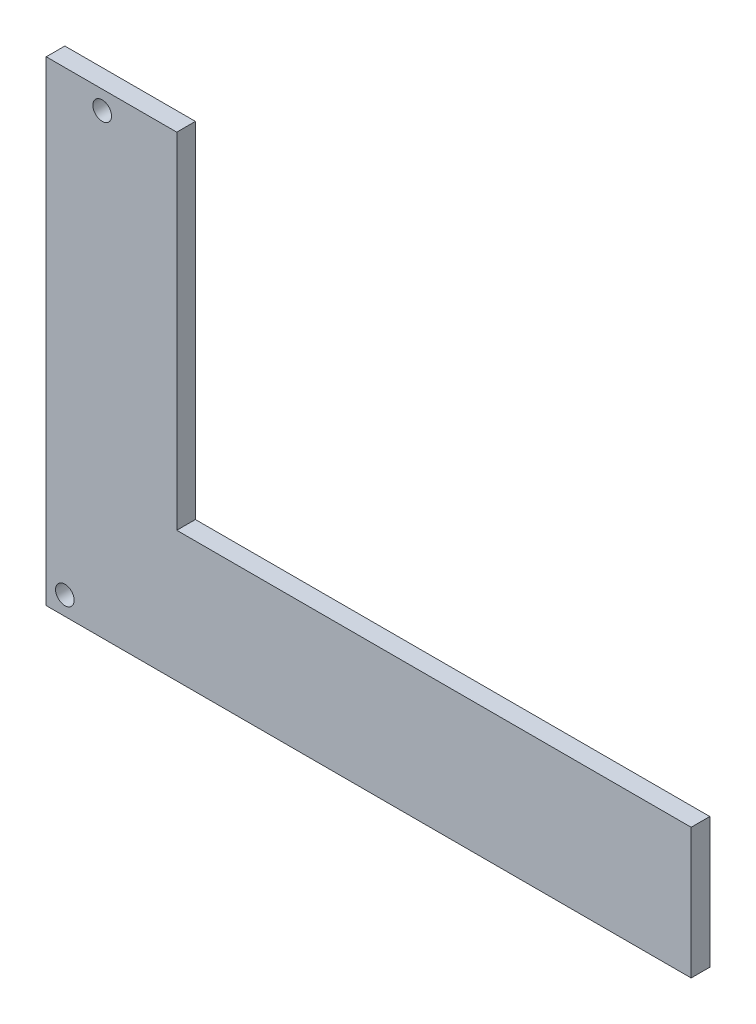
ISO-10303-21;
HEADER;
FILE_DESCRIPTION(('STEP AP214'),'2;1');
FILE_NAME('part.step','',(''),(''),'','','');
FILE_SCHEMA(('AUTOMOTIVE_DESIGN { 1 0 10303 214 1 1 1 1 }'));
ENDSEC;
DATA;
#1=APPLICATION_CONTEXT('core data for automotive mechanical design processes');
#2=APPLICATION_PROTOCOL_DEFINITION('international standard','automotive_design',2000,#1);
#3=PRODUCT_CONTEXT('',#1,'mechanical');
#4=PRODUCT('Part','Part','',(#3));
#5=PRODUCT_RELATED_PRODUCT_CATEGORY('part','',(#4));
#6=PRODUCT_DEFINITION_FORMATION('','',#4);
#7=PRODUCT_DEFINITION_CONTEXT('part definition',#1,'design');
#8=PRODUCT_DEFINITION('design','',#6,#7);
#9=PRODUCT_DEFINITION_SHAPE('','',#8);
#10=(LENGTH_UNIT() NAMED_UNIT(*) SI_UNIT(.MILLI.,.METRE.));
#11=(NAMED_UNIT(*) PLANE_ANGLE_UNIT() SI_UNIT($,.RADIAN.));
#12=(NAMED_UNIT(*) SI_UNIT($,.STERADIAN.) SOLID_ANGLE_UNIT());
#13=UNCERTAINTY_MEASURE_WITH_UNIT(LENGTH_MEASURE(1.E-05),#10,'distance_accuracy_value','');
#14=(GEOMETRIC_REPRESENTATION_CONTEXT(3) GLOBAL_UNCERTAINTY_ASSIGNED_CONTEXT((#13)) GLOBAL_UNIT_ASSIGNED_CONTEXT((#10,
#11,#12)) REPRESENTATION_CONTEXT('',''));
#15=CARTESIAN_POINT('',(0.,0.,0.));
#16=DIRECTION('',(0.,0.,1.));
#17=DIRECTION('',(1.,0.,0.));
#18=AXIS2_PLACEMENT_3D('',#15,#16,#17);
#19=CARTESIAN_POINT('',(155.,-17.9999999999984,5.));
#20=DIRECTION('',(-1.,0.,0.));
#21=DIRECTION('',(0.,0.,1.));
#22=AXIS2_PLACEMENT_3D('',#19,#20,#21);
#23=PLANE('',#22);
#24=DIRECTION('',(0.,1.,0.));
#25=VECTOR('',#24,1.);
#26=CARTESIAN_POINT('',(155.,-17.9999999999984,0.));
#27=LINE('',#26,#25);
#28=CARTESIAN_POINT('',(155.,-17.9999999999984,0.));
#29=VERTEX_POINT('',#28);
#30=CARTESIAN_POINT('',(155.,17.0179350816866,0.));
#31=VERTEX_POINT('',#30);
#32=EDGE_CURVE('E119',#29,#31,#27,.T.);
#33=ORIENTED_EDGE('',*,*,#32,.T.);
#34=DIRECTION('',(0.,0.,-1.));
#35=VECTOR('',#34,1.);
#36=CARTESIAN_POINT('',(155.,17.0179350816866,5.));
#37=LINE('',#36,#35);
#38=CARTESIAN_POINT('',(155.,17.0179350816866,5.));
#39=VERTEX_POINT('',#38);
#40=EDGE_CURVE('E11',#39,#31,#37,.T.);
#41=ORIENTED_EDGE('',*,*,#40,.F.);
#42=DIRECTION('',(0.,1.,0.));
#43=VECTOR('',#42,1.);
#44=CARTESIAN_POINT('',(155.,-17.9999999999984,5.));
#45=LINE('',#44,#43);
#46=CARTESIAN_POINT('',(155.,-17.9999999999984,5.));
#47=VERTEX_POINT('',#46);
#48=EDGE_CURVE('E130',#47,#39,#45,.T.);
#49=ORIENTED_EDGE('',*,*,#48,.F.);
#50=DIRECTION('',(0.,0.,-1.));
#51=VECTOR('',#50,1.);
#52=CARTESIAN_POINT('',(155.,-17.9999999999984,5.));
#53=LINE('',#52,#51);
#54=EDGE_CURVE('E115',#47,#29,#53,.T.);
#55=ORIENTED_EDGE('',*,*,#54,.T.);
#56=EDGE_LOOP('',(#33,#41,#49,#55));
#57=FACE_BOUND('',#56,.T.);
#58=ADVANCED_FACE('F35',(#57),#23,.F.);
#59=CARTESIAN_POINT('',(17.0187176122605,17.0179350816866,5.));
#60=DIRECTION('',(0.,-1.,0.));
#61=DIRECTION('',(1.,0.,0.));
#62=AXIS2_PLACEMENT_3D('',#59,#60,#61);
#63=PLANE('',#62);
#64=DIRECTION('',(-1.,0.,0.));
#65=VECTOR('',#64,1.);
#66=CARTESIAN_POINT('',(17.0187176122605,17.0179350816866,0.));
#67=LINE('',#66,#65);
#68=CARTESIAN_POINT('',(17.0187176122605,17.0179350816866,0.));
#69=VERTEX_POINT('',#68);
#70=EDGE_CURVE('E122',#31,#69,#67,.T.);
#71=ORIENTED_EDGE('',*,*,#70,.T.);
#72=DIRECTION('',(0.,0.,-1.));
#73=VECTOR('',#72,1.);
#74=CARTESIAN_POINT('',(17.0187176122605,17.0179350816866,5.));
#75=LINE('',#74,#73);
#76=CARTESIAN_POINT('',(17.0187176122605,17.0179350816866,5.));
#77=VERTEX_POINT('',#76);
#78=EDGE_CURVE('E43',#77,#69,#75,.T.);
#79=ORIENTED_EDGE('',*,*,#78,.F.);
#80=DIRECTION('',(-1.,0.,0.));
#81=VECTOR('',#80,1.);
#82=CARTESIAN_POINT('',(17.0187176122605,17.0179350816866,5.));
#83=LINE('',#82,#81);
#84=EDGE_CURVE('E88',#39,#77,#83,.T.);
#85=ORIENTED_EDGE('',*,*,#84,.F.);
#86=ORIENTED_EDGE('',*,*,#40,.T.);
#87=EDGE_LOOP('',(#71,#79,#85,#86));
#88=FACE_BOUND('',#87,.T.);
#89=ADVANCED_FACE('F155',(#88),#63,.F.);
#90=CARTESIAN_POINT('',(17.0187176122605,17.0179350816866,5.));
#91=DIRECTION('',(-1.,0.,0.));
#92=DIRECTION('',(0.,-1.,0.));
#93=AXIS2_PLACEMENT_3D('',#90,#91,#92);
#94=PLANE('',#93);
#95=DIRECTION('',(0.,1.,0.));
#96=VECTOR('',#95,1.);
#97=CARTESIAN_POINT('',(17.0187176122605,17.0179350816866,0.));
#98=LINE('',#97,#96);
#99=CARTESIAN_POINT('',(17.0187176122605,109.507702779379,0.));
#100=VERTEX_POINT('',#99);
#101=EDGE_CURVE('E125',#69,#100,#98,.T.);
#102=ORIENTED_EDGE('',*,*,#101,.T.);
#103=DIRECTION('',(0.,0.,-1.));
#104=VECTOR('',#103,1.);
#105=CARTESIAN_POINT('',(17.0187176122605,109.507702779379,5.));
#106=LINE('',#105,#104);
#107=CARTESIAN_POINT('',(17.0187176122605,109.507702779379,5.));
#108=VERTEX_POINT('',#107);
#109=EDGE_CURVE('E110',#108,#100,#106,.T.);
#110=ORIENTED_EDGE('',*,*,#109,.F.);
#111=DIRECTION('',(0.,1.,0.));
#112=VECTOR('',#111,1.);
#113=CARTESIAN_POINT('',(17.0187176122605,17.0179350816866,5.));
#114=LINE('',#113,#112);
#115=EDGE_CURVE('E101',#77,#108,#114,.T.);
#116=ORIENTED_EDGE('',*,*,#115,.F.);
#117=ORIENTED_EDGE('',*,*,#78,.T.);
#118=EDGE_LOOP('',(#102,#110,#116,#117));
#119=FACE_BOUND('',#118,.T.);
#120=ADVANCED_FACE('F136',(#119),#94,.F.);
#121=CARTESIAN_POINT('',(-18.0000000080565,109.507702779379,5.));
#122=DIRECTION('',(0.,-1.,0.));
#123=DIRECTION('',(0.,0.,-1.));
#124=AXIS2_PLACEMENT_3D('',#121,#122,#123);
#125=PLANE('',#124);
#126=DIRECTION('',(-1.,0.,0.));
#127=VECTOR('',#126,1.);
#128=CARTESIAN_POINT('',(-18.0000000080565,109.507702779379,0.));
#129=LINE('',#128,#127);
#130=CARTESIAN_POINT('',(-18.0000000080565,109.507702779379,0.));
#131=VERTEX_POINT('',#130);
#132=EDGE_CURVE('E109',#100,#131,#129,.T.);
#133=ORIENTED_EDGE('',*,*,#132,.T.);
#134=DIRECTION('',(0.,0.,-1.));
#135=VECTOR('',#134,1.);
#136=CARTESIAN_POINT('',(-18.0000000080565,109.507702779379,5.));
#137=LINE('',#136,#135);
#138=CARTESIAN_POINT('',(-18.0000000080565,109.507702779379,5.));
#139=VERTEX_POINT('',#138);
#140=EDGE_CURVE('E106',#139,#131,#137,.T.);
#141=ORIENTED_EDGE('',*,*,#140,.F.);
#142=DIRECTION('',(-1.,0.,0.));
#143=VECTOR('',#142,1.);
#144=CARTESIAN_POINT('',(-18.0000000080565,109.507702779379,5.));
#145=LINE('',#144,#143);
#146=EDGE_CURVE('E95',#108,#139,#145,.T.);
#147=ORIENTED_EDGE('',*,*,#146,.F.);
#148=ORIENTED_EDGE('',*,*,#109,.T.);
#149=EDGE_LOOP('',(#133,#141,#147,#148));
#150=FACE_BOUND('',#149,.T.);
#151=ADVANCED_FACE('F107',(#150),#125,.F.);
#152=CARTESIAN_POINT('',(-18.0000000080565,109.507702779379,5.));
#153=DIRECTION('',(1.,0.,0.));
#154=DIRECTION('',(0.,1.,0.));
#155=AXIS2_PLACEMENT_3D('',#152,#153,#154);
#156=PLANE('',#155);
#157=DIRECTION('',(0.,-1.,0.));
#158=VECTOR('',#157,1.);
#159=CARTESIAN_POINT('',(-18.0000000080565,109.507702779379,0.));
#160=LINE('',#159,#158);
#161=CARTESIAN_POINT('',(-18.0000000080567,-17.9999999999985,0.));
#162=VERTEX_POINT('',#161);
#163=EDGE_CURVE('E74',#131,#162,#160,.T.);
#164=ORIENTED_EDGE('',*,*,#163,.T.);
#165=DIRECTION('',(0.,0.,-1.));
#166=VECTOR('',#165,1.);
#167=CARTESIAN_POINT('',(-18.0000000080567,-17.9999999999985,5.));
#168=LINE('',#167,#166);
#169=CARTESIAN_POINT('',(-18.0000000080567,-17.9999999999985,5.));
#170=VERTEX_POINT('',#169);
#171=EDGE_CURVE('E111',#170,#162,#168,.T.);
#172=ORIENTED_EDGE('',*,*,#171,.F.);
#173=DIRECTION('',(0.,-1.,0.));
#174=VECTOR('',#173,1.);
#175=CARTESIAN_POINT('',(-18.0000000080565,109.507702779379,5.));
#176=LINE('',#175,#174);
#177=EDGE_CURVE('E99',#139,#170,#176,.T.);
#178=ORIENTED_EDGE('',*,*,#177,.F.);
#179=ORIENTED_EDGE('',*,*,#140,.T.);
#180=EDGE_LOOP('',(#164,#172,#178,#179));
#181=FACE_BOUND('',#180,.T.);
#182=ADVANCED_FACE('F113',(#181),#156,.F.);
#183=CARTESIAN_POINT('',(-18.0000000080567,-17.9999999999985,5.));
#184=DIRECTION('',(0.,1.,0.));
#185=DIRECTION('',(-1.,0.,0.));
#186=AXIS2_PLACEMENT_3D('',#183,#184,#185);
#187=PLANE('',#186);
#188=DIRECTION('',(1.,0.,0.));
#189=VECTOR('',#188,1.);
#190=CARTESIAN_POINT('',(-18.0000000080567,-17.9999999999985,0.));
#191=LINE('',#190,#189);
#192=EDGE_CURVE('E80',#162,#29,#191,.T.);
#193=ORIENTED_EDGE('',*,*,#192,.T.);
#194=ORIENTED_EDGE('',*,*,#54,.F.);
#195=DIRECTION('',(1.,0.,0.));
#196=VECTOR('',#195,1.);
#197=CARTESIAN_POINT('',(-18.0000000080567,-17.9999999999985,5.));
#198=LINE('',#197,#196);
#199=EDGE_CURVE('E51',#170,#47,#198,.T.);
#200=ORIENTED_EDGE('',*,*,#199,.F.);
#201=ORIENTED_EDGE('',*,*,#171,.T.);
#202=EDGE_LOOP('',(#193,#194,#200,#201));
#203=FACE_BOUND('',#202,.T.);
#204=ADVANCED_FACE('F143',(#203),#187,.F.);
#205=CARTESIAN_POINT('',(0.,0.,5.));
#206=DIRECTION('',(0.,0.,-1.));
#207=DIRECTION('',(-1.,0.,0.));
#208=AXIS2_PLACEMENT_3D('',#205,#206,#207);
#209=PLANE('',#208);
#210=CARTESIAN_POINT('',(-13.0000000080565,-12.9999999999985,5.));
#211=DIRECTION('',(0.,0.,1.));
#212=DIRECTION('',(1.,0.,0.));
#213=AXIS2_PLACEMENT_3D('',#210,#211,#212);
#214=CIRCLE('',#213,2.49999999999957);
#215=CARTESIAN_POINT('',(-10.500000008057,-12.9999999999985,5.));
#216=VERTEX_POINT('',#215);
#217=EDGE_CURVE('E220',#216,#216,#214,.T.);
#218=ORIENTED_EDGE('',*,*,#217,.F.);
#219=EDGE_LOOP('',(#218));
#220=FACE_BOUND('',#219,.T.);
#221=CARTESIAN_POINT('',(-2.98128238773947,104.507702779379,5.));
#222=DIRECTION('',(0.,0.,1.));
#223=DIRECTION('',(1.,0.,0.));
#224=AXIS2_PLACEMENT_3D('',#221,#222,#223);
#225=CIRCLE('',#224,2.5);
#226=CARTESIAN_POINT('',(-0.481282387739464,104.507702779379,5.));
#227=VERTEX_POINT('',#226);
#228=EDGE_CURVE('E225',#227,#227,#225,.T.);
#229=ORIENTED_EDGE('',*,*,#228,.F.);
#230=EDGE_LOOP('',(#229));
#231=FACE_BOUND('',#230,.T.);
#232=ORIENTED_EDGE('',*,*,#48,.T.);
#233=ORIENTED_EDGE('',*,*,#84,.T.);
#234=ORIENTED_EDGE('',*,*,#115,.T.);
#235=ORIENTED_EDGE('',*,*,#146,.T.);
#236=ORIENTED_EDGE('',*,*,#177,.T.);
#237=ORIENTED_EDGE('',*,*,#199,.T.);
#238=EDGE_LOOP('',(#232,#233,#234,#235,#236,#237));
#239=FACE_BOUND('',#238,.T.);
#240=ADVANCED_FACE('F97',(#220,#231,#239),#209,.F.);
#241=CARTESIAN_POINT('',(0.,0.,0.));
#242=DIRECTION('',(0.,0.,-1.));
#243=DIRECTION('',(-1.,0.,0.));
#244=AXIS2_PLACEMENT_3D('',#241,#242,#243);
#245=PLANE('',#244);
#246=CARTESIAN_POINT('',(-13.0000000080565,-12.9999999999985,0.));
#247=DIRECTION('',(0.,0.,1.));
#248=DIRECTION('',(1.,0.,0.));
#249=AXIS2_PLACEMENT_3D('',#246,#247,#248);
#250=CIRCLE('',#249,2.49999999999957);
#251=CARTESIAN_POINT('',(-10.500000008057,-12.9999999999985,0.));
#252=VERTEX_POINT('',#251);
#253=EDGE_CURVE('E123',#252,#252,#250,.T.);
#254=ORIENTED_EDGE('',*,*,#253,.T.);
#255=EDGE_LOOP('',(#254));
#256=FACE_BOUND('',#255,.T.);
#257=CARTESIAN_POINT('',(-2.98128238773947,104.507702779379,0.));
#258=DIRECTION('',(0.,0.,1.));
#259=DIRECTION('',(1.,0.,0.));
#260=AXIS2_PLACEMENT_3D('',#257,#258,#259);
#261=CIRCLE('',#260,2.5);
#262=CARTESIAN_POINT('',(-0.481282387739464,104.507702779379,0.));
#263=VERTEX_POINT('',#262);
#264=EDGE_CURVE('E221',#263,#263,#261,.T.);
#265=ORIENTED_EDGE('',*,*,#264,.T.);
#266=EDGE_LOOP('',(#265));
#267=FACE_BOUND('',#266,.T.);
#268=ORIENTED_EDGE('',*,*,#32,.F.);
#269=ORIENTED_EDGE('',*,*,#192,.F.);
#270=ORIENTED_EDGE('',*,*,#163,.F.);
#271=ORIENTED_EDGE('',*,*,#132,.F.);
#272=ORIENTED_EDGE('',*,*,#101,.F.);
#273=ORIENTED_EDGE('',*,*,#70,.F.);
#274=EDGE_LOOP('',(#268,#269,#270,#271,#272,#273));
#275=FACE_BOUND('',#274,.T.);
#276=ADVANCED_FACE('F139',(#256,#267,#275),#245,.T.);
#277=CARTESIAN_POINT('',(-2.98128238773947,104.507702779379,0.));
#278=DIRECTION('',(0.,0.,1.));
#279=DIRECTION('',(1.,0.,0.));
#280=AXIS2_PLACEMENT_3D('',#277,#278,#279);
#281=CYLINDRICAL_SURFACE('',#280,2.5);
#282=ORIENTED_EDGE('',*,*,#264,.F.);
#283=EDGE_LOOP('',(#282));
#284=FACE_BOUND('',#283,.T.);
#285=ORIENTED_EDGE('',*,*,#228,.T.);
#286=EDGE_LOOP('',(#285));
#287=FACE_BOUND('',#286,.T.);
#288=ADVANCED_FACE('F192',(#284,#287),#281,.F.);
#289=CARTESIAN_POINT('',(-13.0000000080565,-12.9999999999985,0.));
#290=DIRECTION('',(0.,0.,1.));
#291=DIRECTION('',(1.,0.,0.));
#292=AXIS2_PLACEMENT_3D('',#289,#290,#291);
#293=CYLINDRICAL_SURFACE('',#292,2.49999999999957);
#294=ORIENTED_EDGE('',*,*,#253,.F.);
#295=EDGE_LOOP('',(#294));
#296=FACE_BOUND('',#295,.T.);
#297=ORIENTED_EDGE('',*,*,#217,.T.);
#298=EDGE_LOOP('',(#297));
#299=FACE_BOUND('',#298,.T.);
#300=ADVANCED_FACE('F201',(#296,#299),#293,.F.);
#301=CLOSED_SHELL('',(#58,#89,#120,#151,#182,#204,#240,#276,#288,#300));
#302=MANIFOLD_SOLID_BREP('B2',#301);
#303=ADVANCED_BREP_SHAPE_REPRESENTATION('',(#18,#302),#14);
#304=SHAPE_DEFINITION_REPRESENTATION(#9,#303);
ENDSEC;
END-ISO-10303-21;
